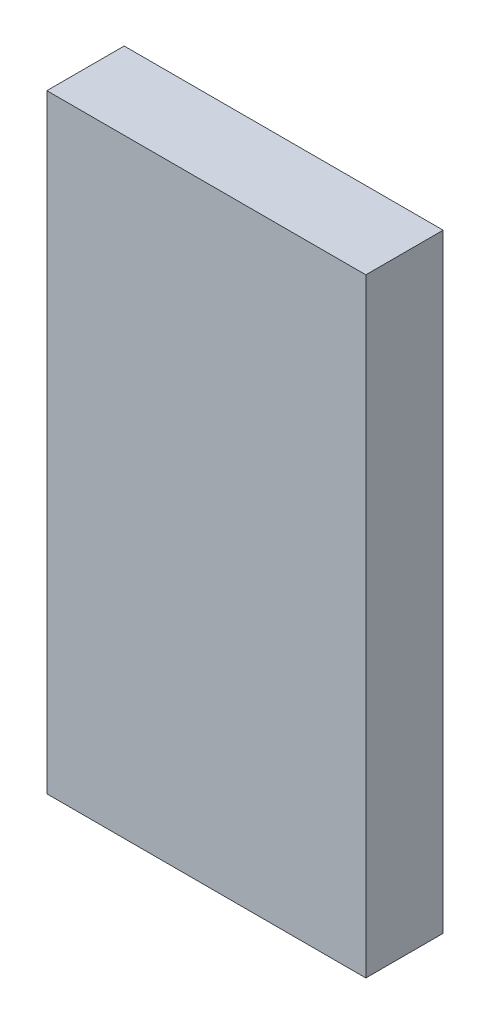
ISO-10303-21;
HEADER;
FILE_DESCRIPTION(('STEP AP214'),'2;1');
FILE_NAME('part.step','',(''),(''),'','','');
FILE_SCHEMA(('AUTOMOTIVE_DESIGN { 1 0 10303 214 1 1 1 1 }'));
ENDSEC;
DATA;
#1=APPLICATION_CONTEXT('core data for automotive mechanical design processes');
#2=APPLICATION_PROTOCOL_DEFINITION('international standard','automotive_design',2000,#1);
#3=PRODUCT_CONTEXT('',#1,'mechanical');
#4=PRODUCT('Part','Part','',(#3));
#5=PRODUCT_RELATED_PRODUCT_CATEGORY('part','',(#4));
#6=PRODUCT_DEFINITION_FORMATION('','',#4);
#7=PRODUCT_DEFINITION_CONTEXT('part definition',#1,'design');
#8=PRODUCT_DEFINITION('design','',#6,#7);
#9=PRODUCT_DEFINITION_SHAPE('','',#8);
#10=(LENGTH_UNIT() NAMED_UNIT(*) SI_UNIT(.MILLI.,.METRE.));
#11=(NAMED_UNIT(*) PLANE_ANGLE_UNIT() SI_UNIT($,.RADIAN.));
#12=(NAMED_UNIT(*) SI_UNIT($,.STERADIAN.) SOLID_ANGLE_UNIT());
#13=UNCERTAINTY_MEASURE_WITH_UNIT(LENGTH_MEASURE(1.E-05),#10,'distance_accuracy_value','');
#14=(GEOMETRIC_REPRESENTATION_CONTEXT(3) GLOBAL_UNCERTAINTY_ASSIGNED_CONTEXT((#13)) GLOBAL_UNIT_ASSIGNED_CONTEXT((#10,
#11,#12)) REPRESENTATION_CONTEXT('',''));
#15=CARTESIAN_POINT('',(0.,0.,0.));
#16=DIRECTION('',(0.,0.,1.));
#17=DIRECTION('',(1.,0.,0.));
#18=AXIS2_PLACEMENT_3D('',#15,#16,#17);
#19=CARTESIAN_POINT('',(4.37219908463765,-13.9190292556628,1.03674100988133E-06));
#20=DIRECTION('',(0.,8.74227339409094E-08,-1.));
#21=DIRECTION('',(-4.37113882867396E-08,-1.,-8.74227339409093E-08));
#22=AXIS2_PLACEMENT_3D('',#19,#20,#21);
#23=PLANE('',#22);
#24=DIRECTION('',(4.37113884244161E-08,1.,8.74227339409093E-08));
#25=VECTOR('',#24,1.);
#26=CARTESIAN_POINT('',(6.02219908463764,-13.9190293277866,1.03674100337611E-06));
#27=LINE('',#26,#25);
#28=CARTESIAN_POINT('',(6.02219894694678,-17.0690293277866,7.61359391764777E-07));
#29=VERTEX_POINT('',#28);
#30=CARTESIAN_POINT('',(6.02219922232852,-10.7690293277866,1.31212261542113E-06));
#31=VERTEX_POINT('',#30);
#32=EDGE_CURVE('E90',#29,#31,#27,.T.);
#33=ORIENTED_EDGE('',*,*,#32,.T.);
#34=DIRECTION('',(-1.,4.37113882867395E-08,0.));
#35=VECTOR('',#34,1.);
#36=CARTESIAN_POINT('',(4.37219922232854,-10.7690292556628,1.31212262192634E-06));
#37=LINE('',#36,#35);
#38=CARTESIAN_POINT('',(2.72219922232852,-10.769029183539,1.31212262799787E-06));
#39=VERTEX_POINT('',#38);
#40=EDGE_CURVE('E27',#31,#39,#37,.T.);
#41=ORIENTED_EDGE('',*,*,#40,.T.);
#42=DIRECTION('',(4.37113884244161E-08,1.,8.74227339409093E-08));
#43=VECTOR('',#42,1.);
#44=CARTESIAN_POINT('',(2.72219908463766,-13.919029183539,1.03674101638654E-06));
#45=LINE('',#44,#43);
#46=CARTESIAN_POINT('',(2.72219894694678,-17.069029183539,7.61359404341522E-07));
#47=VERTEX_POINT('',#46);
#48=EDGE_CURVE('E78',#47,#39,#45,.T.);
#49=ORIENTED_EDGE('',*,*,#48,.F.);
#50=DIRECTION('',(-1.,4.37113882867395E-08,0.));
#51=VECTOR('',#50,1.);
#52=CARTESIAN_POINT('',(4.37219894694676,-17.0690292556628,7.61359397836309E-07));
#53=LINE('',#52,#51);
#54=EDGE_CURVE('E101',#29,#47,#53,.T.);
#55=ORIENTED_EDGE('',*,*,#54,.F.);
#56=EDGE_LOOP('',(#33,#41,#49,#55));
#57=FACE_BOUND('',#56,.T.);
#58=ADVANCED_FACE('F17',(#57),#23,.F.);
#59=CARTESIAN_POINT('',(4.37219908463765,-13.9190291857246,-0.799998963258987));
#60=DIRECTION('',(0.,8.74227339409094E-08,-1.));
#61=DIRECTION('',(-4.37113882867396E-08,-1.,-8.74227339409093E-08));
#62=AXIS2_PLACEMENT_3D('',#59,#60,#61);
#63=PLANE('',#62);
#64=DIRECTION('',(4.37113884244161E-08,1.,8.74227339409093E-08));
#65=VECTOR('',#64,1.);
#66=CARTESIAN_POINT('',(6.02219908463764,-13.9190292578484,-0.799998963258994));
#67=LINE('',#66,#65);
#68=CARTESIAN_POINT('',(6.02219894694678,-17.0690292578483,-0.799999238640606));
#69=VERTEX_POINT('',#68);
#70=CARTESIAN_POINT('',(6.02219922232852,-10.7690292578484,-0.799998687877382));
#71=VERTEX_POINT('',#70);
#72=EDGE_CURVE('E81',#69,#71,#67,.T.);
#73=ORIENTED_EDGE('',*,*,#72,.F.);
#74=DIRECTION('',(-1.,4.37113882867395E-08,0.));
#75=VECTOR('',#74,1.);
#76=CARTESIAN_POINT('',(4.37219894694676,-17.0690291857246,-0.7999992386406));
#77=LINE('',#76,#75);
#78=CARTESIAN_POINT('',(2.72219894694678,-17.0690291136008,-0.799999238640593));
#79=VERTEX_POINT('',#78);
#80=EDGE_CURVE('E67',#69,#79,#77,.T.);
#81=ORIENTED_EDGE('',*,*,#80,.T.);
#82=DIRECTION('',(4.37113884244161E-08,1.,8.74227339409093E-08));
#83=VECTOR('',#82,1.);
#84=CARTESIAN_POINT('',(2.72219908463766,-13.9190291136008,-0.799998963258981));
#85=LINE('',#84,#83);
#86=CARTESIAN_POINT('',(2.72219922232852,-10.7690291136008,-0.799998687877369));
#87=VERTEX_POINT('',#86);
#88=EDGE_CURVE('E111',#79,#87,#85,.T.);
#89=ORIENTED_EDGE('',*,*,#88,.T.);
#90=DIRECTION('',(-1.,4.37113882867395E-08,0.));
#91=VECTOR('',#90,1.);
#92=CARTESIAN_POINT('',(4.37219922232854,-10.7690291857246,-0.799998687877376));
#93=LINE('',#92,#91);
#94=EDGE_CURVE('E11',#71,#87,#93,.T.);
#95=ORIENTED_EDGE('',*,*,#94,.F.);
#96=EDGE_LOOP('',(#73,#81,#89,#95));
#97=FACE_BOUND('',#96,.T.);
#98=ADVANCED_FACE('F82',(#97),#63,.T.);
#99=CARTESIAN_POINT('',(4.37219922232854,-10.7690291857246,-0.799998687877376));
#100=DIRECTION('',(4.37113882867396E-08,1.,8.74227339409093E-08));
#101=DIRECTION('',(0.,8.74227339409094E-08,-1.));
#102=AXIS2_PLACEMENT_3D('',#99,#100,#101);
#103=PLANE('',#102);
#104=ORIENTED_EDGE('',*,*,#40,.F.);
#105=DIRECTION('',(0.,-8.74227339409094E-08,1.));
#106=VECTOR('',#105,1.);
#107=CARTESIAN_POINT('',(6.02219922232852,-10.7690292578484,-0.799998687877382));
#108=LINE('',#107,#106);
#109=EDGE_CURVE('E86',#71,#31,#108,.T.);
#110=ORIENTED_EDGE('',*,*,#109,.F.);
#111=ORIENTED_EDGE('',*,*,#94,.T.);
#112=DIRECTION('',(0.,-8.74227339409094E-08,1.));
#113=VECTOR('',#112,1.);
#114=CARTESIAN_POINT('',(2.72219922232852,-10.7690291136008,-0.799998687877369));
#115=LINE('',#114,#113);
#116=EDGE_CURVE('E108',#87,#39,#115,.T.);
#117=ORIENTED_EDGE('',*,*,#116,.T.);
#118=EDGE_LOOP('',(#104,#110,#111,#117));
#119=FACE_BOUND('',#118,.T.);
#120=ADVANCED_FACE('F140',(#119),#103,.T.);
#121=CARTESIAN_POINT('',(2.72219908463766,-13.9190291136008,-0.799998963258981));
#122=DIRECTION('',(1.,-4.37113884244159E-08,0.));
#123=DIRECTION('',(-4.37113884244161E-08,-1.,-8.74227339409093E-08));
#124=AXIS2_PLACEMENT_3D('',#121,#122,#123);
#125=PLANE('',#124);
#126=ORIENTED_EDGE('',*,*,#48,.T.);
#127=ORIENTED_EDGE('',*,*,#116,.F.);
#128=ORIENTED_EDGE('',*,*,#88,.F.);
#129=DIRECTION('',(0.,-8.74227339409094E-08,1.));
#130=VECTOR('',#129,1.);
#131=CARTESIAN_POINT('',(2.72219894694678,-17.0690291136008,-0.799999238640593));
#132=LINE('',#131,#130);
#133=EDGE_CURVE('E75',#79,#47,#132,.T.);
#134=ORIENTED_EDGE('',*,*,#133,.T.);
#135=EDGE_LOOP('',(#126,#127,#128,#134));
#136=FACE_BOUND('',#135,.T.);
#137=ADVANCED_FACE('F139',(#136),#125,.F.);
#138=CARTESIAN_POINT('',(4.37219894694676,-17.0690291857246,-0.7999992386406));
#139=DIRECTION('',(4.37113882867396E-08,1.,8.74227339409093E-08));
#140=DIRECTION('',(0.,8.74227339409094E-08,-1.));
#141=AXIS2_PLACEMENT_3D('',#138,#139,#140);
#142=PLANE('',#141);
#143=ORIENTED_EDGE('',*,*,#54,.T.);
#144=ORIENTED_EDGE('',*,*,#133,.F.);
#145=ORIENTED_EDGE('',*,*,#80,.F.);
#146=DIRECTION('',(0.,-8.74227339409094E-08,1.));
#147=VECTOR('',#146,1.);
#148=CARTESIAN_POINT('',(6.02219894694678,-17.0690292578483,-0.799999238640606));
#149=LINE('',#148,#147);
#150=EDGE_CURVE('E72',#69,#29,#149,.T.);
#151=ORIENTED_EDGE('',*,*,#150,.T.);
#152=EDGE_LOOP('',(#143,#144,#145,#151));
#153=FACE_BOUND('',#152,.T.);
#154=ADVANCED_FACE('F70',(#153),#142,.F.);
#155=CARTESIAN_POINT('',(6.02219908463764,-13.9190292578484,-0.799998963258994));
#156=DIRECTION('',(1.,-4.37113884244159E-08,0.));
#157=DIRECTION('',(-4.37113884244161E-08,-1.,-8.74227339409093E-08));
#158=AXIS2_PLACEMENT_3D('',#155,#156,#157);
#159=PLANE('',#158);
#160=ORIENTED_EDGE('',*,*,#32,.F.);
#161=ORIENTED_EDGE('',*,*,#150,.F.);
#162=ORIENTED_EDGE('',*,*,#72,.T.);
#163=ORIENTED_EDGE('',*,*,#109,.T.);
#164=EDGE_LOOP('',(#160,#161,#162,#163));
#165=FACE_BOUND('',#164,.T.);
#166=ADVANCED_FACE('F88',(#165),#159,.T.);
#167=CLOSED_SHELL('',(#58,#98,#120,#137,#154,#166));
#168=MANIFOLD_SOLID_BREP('B1',#167);
#169=ADVANCED_BREP_SHAPE_REPRESENTATION('',(#18,#168),#14);
#170=SHAPE_DEFINITION_REPRESENTATION(#9,#169);
ENDSEC;
END-ISO-10303-21;
